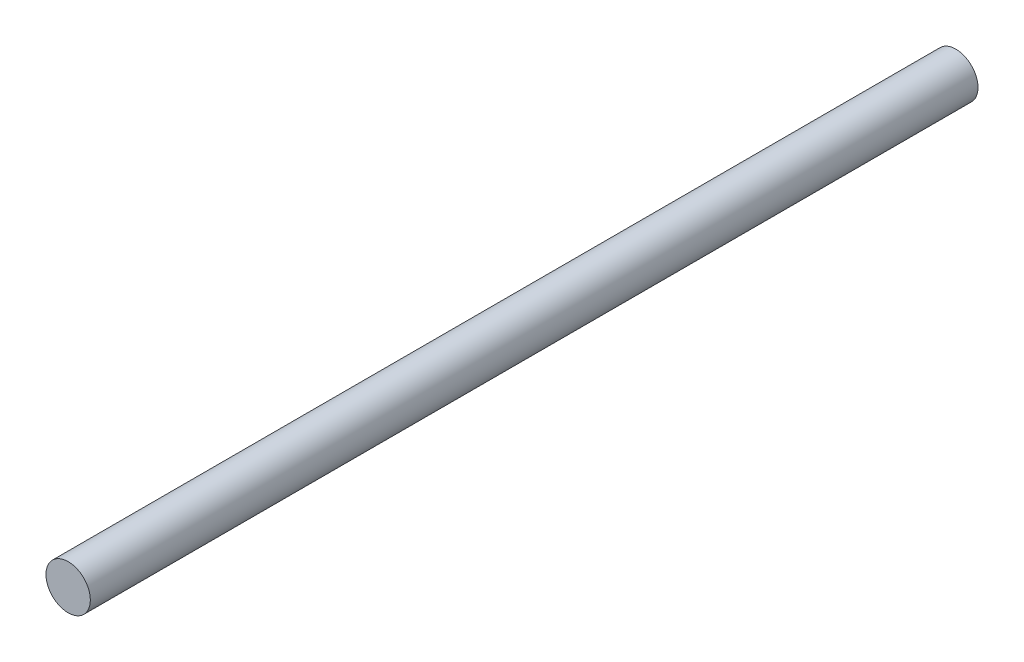
ISO-10303-21;
HEADER;
FILE_DESCRIPTION(('STEP AP214'),'2;1');
FILE_NAME('part.step','',(''),(''),'','','');
FILE_SCHEMA(('AUTOMOTIVE_DESIGN { 1 0 10303 214 1 1 1 1 }'));
ENDSEC;
DATA;
#1=APPLICATION_CONTEXT('core data for automotive mechanical design processes');
#2=APPLICATION_PROTOCOL_DEFINITION('international standard','automotive_design',2000,#1);
#3=PRODUCT_CONTEXT('',#1,'mechanical');
#4=PRODUCT('Part','Part','',(#3));
#5=PRODUCT_RELATED_PRODUCT_CATEGORY('part','',(#4));
#6=PRODUCT_DEFINITION_FORMATION('','',#4);
#7=PRODUCT_DEFINITION_CONTEXT('part definition',#1,'design');
#8=PRODUCT_DEFINITION('design','',#6,#7);
#9=PRODUCT_DEFINITION_SHAPE('','',#8);
#10=(LENGTH_UNIT() NAMED_UNIT(*) SI_UNIT(.MILLI.,.METRE.));
#11=(NAMED_UNIT(*) PLANE_ANGLE_UNIT() SI_UNIT($,.RADIAN.));
#12=(NAMED_UNIT(*) SI_UNIT($,.STERADIAN.) SOLID_ANGLE_UNIT());
#13=UNCERTAINTY_MEASURE_WITH_UNIT(LENGTH_MEASURE(1.E-05),#10,'distance_accuracy_value','');
#14=(GEOMETRIC_REPRESENTATION_CONTEXT(3) GLOBAL_UNCERTAINTY_ASSIGNED_CONTEXT((#13)) GLOBAL_UNIT_ASSIGNED_CONTEXT((#10,
#11,#12)) REPRESENTATION_CONTEXT('',''));
#15=CARTESIAN_POINT('',(0.,0.,0.));
#16=DIRECTION('',(0.,0.,1.));
#17=DIRECTION('',(1.,0.,0.));
#18=AXIS2_PLACEMENT_3D('',#15,#16,#17);
#19=CARTESIAN_POINT('',(0.,0.,127.));
#20=DIRECTION('',(0.,0.,-1.));
#21=DIRECTION('',(-1.,0.,0.));
#22=AXIS2_PLACEMENT_3D('',#19,#20,#21);
#23=CYLINDRICAL_SURFACE('',#22,3.175);
#24=CARTESIAN_POINT('',(0.,0.,127.));
#25=DIRECTION('',(0.,0.,1.));
#26=DIRECTION('',(1.,0.,0.));
#27=AXIS2_PLACEMENT_3D('',#24,#25,#26);
#28=CIRCLE('',#27,3.175);
#29=CARTESIAN_POINT('',(3.175,0.,127.));
#30=VERTEX_POINT('',#29);
#31=EDGE_CURVE('E10',#30,#30,#28,.T.);
#32=ORIENTED_EDGE('',*,*,#31,.F.);
#33=EDGE_LOOP('',(#32));
#34=FACE_BOUND('',#33,.T.);
#35=CARTESIAN_POINT('',(0.,0.,0.));
#36=DIRECTION('',(0.,0.,1.));
#37=DIRECTION('',(1.,0.,0.));
#38=AXIS2_PLACEMENT_3D('',#35,#36,#37);
#39=CIRCLE('',#38,3.175);
#40=CARTESIAN_POINT('',(3.175,0.,0.));
#41=VERTEX_POINT('',#40);
#42=EDGE_CURVE('E38',#41,#41,#39,.T.);
#43=ORIENTED_EDGE('',*,*,#42,.T.);
#44=EDGE_LOOP('',(#43));
#45=FACE_BOUND('',#44,.T.);
#46=ADVANCED_FACE('F35',(#34,#45),#23,.T.);
#47=CARTESIAN_POINT('',(0.,0.,127.));
#48=DIRECTION('',(0.,0.,1.));
#49=DIRECTION('',(1.,0.,0.));
#50=AXIS2_PLACEMENT_3D('',#47,#48,#49);
#51=PLANE('',#50);
#52=ORIENTED_EDGE('',*,*,#31,.T.);
#53=EDGE_LOOP('',(#52));
#54=FACE_BOUND('',#53,.T.);
#55=ADVANCED_FACE('F50',(#54),#51,.T.);
#56=CARTESIAN_POINT('',(0.,0.,0.));
#57=DIRECTION('',(0.,0.,1.));
#58=DIRECTION('',(1.,0.,0.));
#59=AXIS2_PLACEMENT_3D('',#56,#57,#58);
#60=PLANE('',#59);
#61=ORIENTED_EDGE('',*,*,#42,.F.);
#62=EDGE_LOOP('',(#61));
#63=FACE_BOUND('',#62,.T.);
#64=ADVANCED_FACE('F48',(#63),#60,.F.);
#65=CLOSED_SHELL('',(#46,#55,#64));
#66=MANIFOLD_SOLID_BREP('B2',#65);
#67=ADVANCED_BREP_SHAPE_REPRESENTATION('',(#18,#66),#14);
#68=SHAPE_DEFINITION_REPRESENTATION(#9,#67);
ENDSEC;
END-ISO-10303-21;
